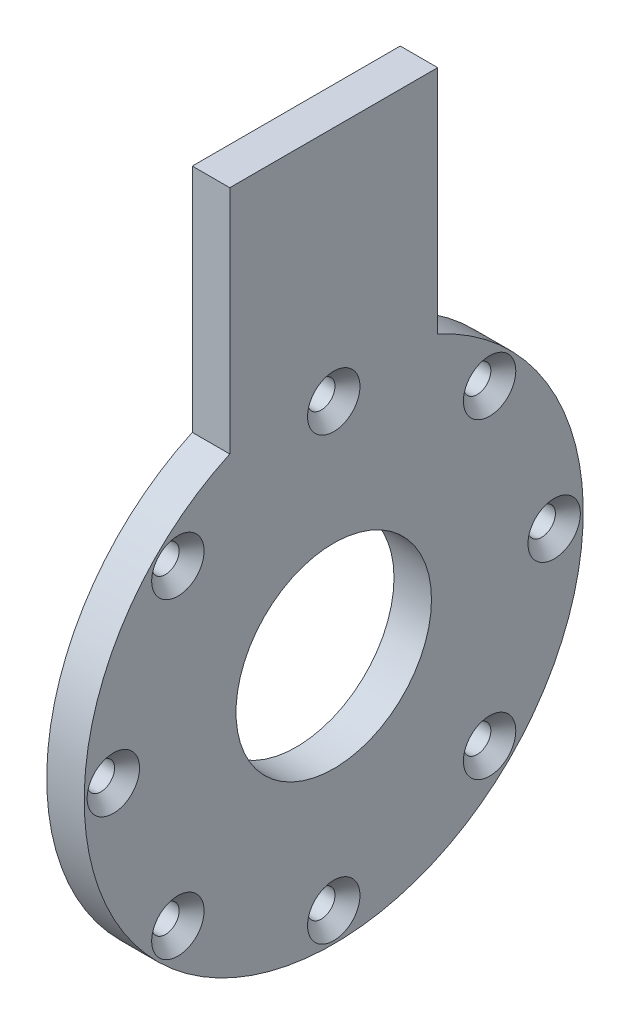
ISO-10303-21;
HEADER;
FILE_DESCRIPTION(('STEP AP214'),'2;1');
FILE_NAME('part.step','',(''),(''),'','','');
FILE_SCHEMA(('AUTOMOTIVE_DESIGN { 1 0 10303 214 1 1 1 1 }'));
ENDSEC;
DATA;
#1=APPLICATION_CONTEXT('core data for automotive mechanical design processes');
#2=APPLICATION_PROTOCOL_DEFINITION('international standard','automotive_design',2000,#1);
#3=PRODUCT_CONTEXT('',#1,'mechanical');
#4=PRODUCT('Part','Part','',(#3));
#5=PRODUCT_RELATED_PRODUCT_CATEGORY('part','',(#4));
#6=PRODUCT_DEFINITION_FORMATION('','',#4);
#7=PRODUCT_DEFINITION_CONTEXT('part definition',#1,'design');
#8=PRODUCT_DEFINITION('design','',#6,#7);
#9=PRODUCT_DEFINITION_SHAPE('','',#8);
#10=(LENGTH_UNIT() NAMED_UNIT(*) SI_UNIT(.MILLI.,.METRE.));
#11=(NAMED_UNIT(*) PLANE_ANGLE_UNIT() SI_UNIT($,.RADIAN.));
#12=(NAMED_UNIT(*) SI_UNIT($,.STERADIAN.) SOLID_ANGLE_UNIT());
#13=UNCERTAINTY_MEASURE_WITH_UNIT(LENGTH_MEASURE(1.E-05),#10,'distance_accuracy_value','');
#14=(GEOMETRIC_REPRESENTATION_CONTEXT(3) GLOBAL_UNCERTAINTY_ASSIGNED_CONTEXT((#13)) GLOBAL_UNIT_ASSIGNED_CONTEXT((#10,
#11,#12)) REPRESENTATION_CONTEXT('',''));
#15=CARTESIAN_POINT('',(0.,0.,0.));
#16=DIRECTION('',(0.,0.,1.));
#17=DIRECTION('',(1.,0.,0.));
#18=AXIS2_PLACEMENT_3D('',#15,#16,#17);
#19=CARTESIAN_POINT('',(-0.01,0.,0.));
#20=DIRECTION('',(1.,0.,0.));
#21=DIRECTION('',(0.,0.,-1.));
#22=AXIS2_PLACEMENT_3D('',#19,#20,#21);
#23=CYLINDRICAL_SURFACE('',#22,60.);
#24=DIRECTION('',(1.,0.,0.));
#25=VECTOR('',#24,1.);
#26=CARTESIAN_POINT('',(-0.01,54.5435605731786,-25.));
#27=LINE('',#26,#25);
#28=CARTESIAN_POINT('',(-0.01,54.5435605731786,-25.));
#29=VERTEX_POINT('',#28);
#30=CARTESIAN_POINT('',(9.,54.5435605731786,-25.));
#31=VERTEX_POINT('',#30);
#32=EDGE_CURVE('E55',#29,#31,#27,.T.);
#33=ORIENTED_EDGE('',*,*,#32,.T.);
#34=CARTESIAN_POINT('',(9.,0.,0.));
#35=DIRECTION('',(1.,0.,0.));
#36=DIRECTION('',(0.,0.,-1.));
#37=AXIS2_PLACEMENT_3D('',#34,#35,#36);
#38=CIRCLE('',#37,60.);
#39=CARTESIAN_POINT('',(9.,54.5435605731786,25.));
#40=VERTEX_POINT('',#39);
#41=EDGE_CURVE('E93',#40,#31,#38,.T.);
#42=ORIENTED_EDGE('',*,*,#41,.F.);
#43=DIRECTION('',(1.,0.,0.));
#44=VECTOR('',#43,1.);
#45=CARTESIAN_POINT('',(-0.01,54.5435605731786,25.));
#46=LINE('',#45,#44);
#47=CARTESIAN_POINT('',(-0.01,54.5435605731786,25.));
#48=VERTEX_POINT('',#47);
#49=EDGE_CURVE('E12',#48,#40,#46,.T.);
#50=ORIENTED_EDGE('',*,*,#49,.F.);
#51=CARTESIAN_POINT('',(-0.01,0.,0.));
#52=DIRECTION('',(1.,0.,0.));
#53=DIRECTION('',(0.,0.,-1.));
#54=AXIS2_PLACEMENT_3D('',#51,#52,#53);
#55=CIRCLE('',#54,60.);
#56=EDGE_CURVE('E94',#48,#29,#55,.T.);
#57=ORIENTED_EDGE('',*,*,#56,.T.);
#58=EDGE_LOOP('',(#33,#42,#50,#57));
#59=FACE_BOUND('',#58,.T.);
#60=ADVANCED_FACE('F52',(#59),#23,.T.);
#61=CARTESIAN_POINT('',(-0.01,110.,25.));
#62=DIRECTION('',(0.,0.,1.));
#63=DIRECTION('',(1.,0.,0.));
#64=AXIS2_PLACEMENT_3D('',#61,#62,#63);
#65=PLANE('',#64);
#66=ORIENTED_EDGE('',*,*,#49,.T.);
#67=DIRECTION('',(0.,-1.,0.));
#68=VECTOR('',#67,1.);
#69=CARTESIAN_POINT('',(9.,110.,25.));
#70=LINE('',#69,#68);
#71=CARTESIAN_POINT('',(9.,110.,25.));
#72=VERTEX_POINT('',#71);
#73=EDGE_CURVE('E113',#72,#40,#70,.T.);
#74=ORIENTED_EDGE('',*,*,#73,.F.);
#75=DIRECTION('',(1.,0.,0.));
#76=VECTOR('',#75,1.);
#77=CARTESIAN_POINT('',(-0.01,110.,25.));
#78=LINE('',#77,#76);
#79=CARTESIAN_POINT('',(-0.01,110.,25.));
#80=VERTEX_POINT('',#79);
#81=EDGE_CURVE('E61',#80,#72,#78,.T.);
#82=ORIENTED_EDGE('',*,*,#81,.F.);
#83=DIRECTION('',(0.,-1.,0.));
#84=VECTOR('',#83,1.);
#85=CARTESIAN_POINT('',(-0.01,110.,25.));
#86=LINE('',#85,#84);
#87=EDGE_CURVE('E100',#80,#48,#86,.T.);
#88=ORIENTED_EDGE('',*,*,#87,.T.);
#89=EDGE_LOOP('',(#66,#74,#82,#88));
#90=FACE_BOUND('',#89,.T.);
#91=ADVANCED_FACE('F387',(#90),#65,.T.);
#92=CARTESIAN_POINT('',(-0.01,110.,25.));
#93=DIRECTION('',(0.,1.,0.));
#94=DIRECTION('',(0.,0.,1.));
#95=AXIS2_PLACEMENT_3D('',#92,#93,#94);
#96=PLANE('',#95);
#97=ORIENTED_EDGE('',*,*,#81,.T.);
#98=DIRECTION('',(0.,0.,1.));
#99=VECTOR('',#98,1.);
#100=CARTESIAN_POINT('',(9.,110.,25.));
#101=LINE('',#100,#99);
#102=CARTESIAN_POINT('',(9.,110.,-25.));
#103=VERTEX_POINT('',#102);
#104=EDGE_CURVE('E108',#103,#72,#101,.T.);
#105=ORIENTED_EDGE('',*,*,#104,.F.);
#106=DIRECTION('',(1.,0.,0.));
#107=VECTOR('',#106,1.);
#108=CARTESIAN_POINT('',(-0.01,110.,-25.));
#109=LINE('',#108,#107);
#110=CARTESIAN_POINT('',(-0.01,110.,-25.));
#111=VERTEX_POINT('',#110);
#112=EDGE_CURVE('E99',#111,#103,#109,.T.);
#113=ORIENTED_EDGE('',*,*,#112,.F.);
#114=DIRECTION('',(0.,0.,1.));
#115=VECTOR('',#114,1.);
#116=CARTESIAN_POINT('',(-0.01,110.,25.));
#117=LINE('',#116,#115);
#118=EDGE_CURVE('E205',#111,#80,#117,.T.);
#119=ORIENTED_EDGE('',*,*,#118,.T.);
#120=EDGE_LOOP('',(#97,#105,#113,#119));
#121=FACE_BOUND('',#120,.T.);
#122=ADVANCED_FACE('F391',(#121),#96,.T.);
#123=CARTESIAN_POINT('',(-0.01,110.,-25.));
#124=DIRECTION('',(0.,0.,-1.));
#125=DIRECTION('',(-1.,0.,0.));
#126=AXIS2_PLACEMENT_3D('',#123,#124,#125);
#127=PLANE('',#126);
#128=ORIENTED_EDGE('',*,*,#112,.T.);
#129=DIRECTION('',(0.,1.,0.));
#130=VECTOR('',#129,1.);
#131=CARTESIAN_POINT('',(9.,110.,-25.));
#132=LINE('',#131,#130);
#133=EDGE_CURVE('E102',#31,#103,#132,.T.);
#134=ORIENTED_EDGE('',*,*,#133,.F.);
#135=ORIENTED_EDGE('',*,*,#32,.F.);
#136=DIRECTION('',(0.,1.,0.));
#137=VECTOR('',#136,1.);
#138=CARTESIAN_POINT('',(-0.01,110.,-25.));
#139=LINE('',#138,#137);
#140=EDGE_CURVE('E202',#29,#111,#139,.T.);
#141=ORIENTED_EDGE('',*,*,#140,.T.);
#142=EDGE_LOOP('',(#128,#134,#135,#141));
#143=FACE_BOUND('',#142,.T.);
#144=ADVANCED_FACE('F103',(#143),#127,.T.);
#145=CARTESIAN_POINT('',(-0.01,0.,0.));
#146=DIRECTION('',(1.,0.,0.));
#147=DIRECTION('',(0.,0.,-1.));
#148=AXIS2_PLACEMENT_3D('',#145,#146,#147);
#149=PLANE('',#148);
#150=CARTESIAN_POINT('',(-0.00999999999999959,53.,0.));
#151=DIRECTION('',(1.,0.,0.));
#152=DIRECTION('',(0.,0.,-1.));
#153=AXIS2_PLACEMENT_3D('',#150,#151,#152);
#154=CIRCLE('',#153,3.3);
#155=CARTESIAN_POINT('',(-0.00999999999999959,53.,-3.3));
#156=VERTEX_POINT('',#155);
#157=EDGE_CURVE('E321',#156,#156,#154,.T.);
#158=ORIENTED_EDGE('',*,*,#157,.T.);
#159=EDGE_LOOP('',(#158));
#160=FACE_BOUND('',#159,.T.);
#161=CARTESIAN_POINT('',(-0.00999999999999959,37.476659402887,-37.476659402887));
#162=DIRECTION('',(1.,0.,0.));
#163=DIRECTION('',(0.,0.,-1.));
#164=AXIS2_PLACEMENT_3D('',#161,#162,#163);
#165=CIRCLE('',#164,3.3);
#166=CARTESIAN_POINT('',(-0.00999999999999959,37.476659402887,-40.776659402887));
#167=VERTEX_POINT('',#166);
#168=EDGE_CURVE('E303',#167,#167,#165,.T.);
#169=ORIENTED_EDGE('',*,*,#168,.T.);
#170=EDGE_LOOP('',(#169));
#171=FACE_BOUND('',#170,.T.);
#172=CARTESIAN_POINT('',(-0.00999999999999959,-1.85048510958686E-13,-53.));
#173=DIRECTION('',(1.,0.,0.));
#174=DIRECTION('',(0.,0.,-1.));
#175=AXIS2_PLACEMENT_3D('',#172,#173,#174);
#176=CIRCLE('',#175,3.3);
#177=CARTESIAN_POINT('',(-0.00999999999999959,-1.85048510958686E-13,-56.3));
#178=VERTEX_POINT('',#177);
#179=EDGE_CURVE('E287',#178,#178,#176,.T.);
#180=ORIENTED_EDGE('',*,*,#179,.T.);
#181=EDGE_LOOP('',(#180));
#182=FACE_BOUND('',#181,.T.);
#183=CARTESIAN_POINT('',(-0.00999999999999959,-37.4766594028872,-37.4766594028868));
#184=DIRECTION('',(1.,0.,0.));
#185=DIRECTION('',(0.,0.,-1.));
#186=AXIS2_PLACEMENT_3D('',#183,#184,#185);
#187=CIRCLE('',#186,3.3);
#188=CARTESIAN_POINT('',(-0.00999999999999959,-37.4766594028872,-40.7766594028868));
#189=VERTEX_POINT('',#188);
#190=EDGE_CURVE('E271',#189,#189,#187,.T.);
#191=ORIENTED_EDGE('',*,*,#190,.T.);
#192=EDGE_LOOP('',(#191));
#193=FACE_BOUND('',#192,.T.);
#194=CARTESIAN_POINT('',(-0.00999999999999959,-53.,3.70097021917372E-13));
#195=DIRECTION('',(1.,0.,0.));
#196=DIRECTION('',(0.,0.,-1.));
#197=AXIS2_PLACEMENT_3D('',#194,#195,#196);
#198=CIRCLE('',#197,3.3);
#199=CARTESIAN_POINT('',(-0.00999999999999959,-53.,-3.29999999999963));
#200=VERTEX_POINT('',#199);
#201=EDGE_CURVE('E142',#200,#200,#198,.T.);
#202=ORIENTED_EDGE('',*,*,#201,.T.);
#203=EDGE_LOOP('',(#202));
#204=FACE_BOUND('',#203,.T.);
#205=CARTESIAN_POINT('',(-0.00999999999999959,-37.4766594028867,37.4766594028873));
#206=DIRECTION('',(1.,0.,0.));
#207=DIRECTION('',(0.,0.,-1.));
#208=AXIS2_PLACEMENT_3D('',#205,#206,#207);
#209=CIRCLE('',#208,3.3);
#210=CARTESIAN_POINT('',(-0.00999999999999959,-37.4766594028867,34.1766594028874));
#211=VERTEX_POINT('',#210);
#212=EDGE_CURVE('E157',#211,#211,#209,.T.);
#213=ORIENTED_EDGE('',*,*,#212,.T.);
#214=EDGE_LOOP('',(#213));
#215=FACE_BOUND('',#214,.T.);
#216=CARTESIAN_POINT('',(-0.00999999999999959,5.55145532876058E-13,53.));
#217=DIRECTION('',(1.,0.,0.));
#218=DIRECTION('',(0.,0.,-1.));
#219=AXIS2_PLACEMENT_3D('',#216,#217,#218);
#220=CIRCLE('',#219,3.3);
#221=CARTESIAN_POINT('',(-0.00999999999999959,5.55145532876058E-13,49.7));
#222=VERTEX_POINT('',#221);
#223=EDGE_CURVE('E174',#222,#222,#220,.T.);
#224=ORIENTED_EDGE('',*,*,#223,.T.);
#225=EDGE_LOOP('',(#224));
#226=FACE_BOUND('',#225,.T.);
#227=CARTESIAN_POINT('',(-0.00999999999999959,37.476659402887,37.476659402887));
#228=DIRECTION('',(1.,0.,0.));
#229=DIRECTION('',(0.,0.,-1.));
#230=AXIS2_PLACEMENT_3D('',#227,#228,#229);
#231=CIRCLE('',#230,3.3);
#232=CARTESIAN_POINT('',(-0.00999999999999959,37.476659402887,34.176659402887));
#233=VERTEX_POINT('',#232);
#234=EDGE_CURVE('E120',#233,#233,#231,.T.);
#235=ORIENTED_EDGE('',*,*,#234,.T.);
#236=EDGE_LOOP('',(#235));
#237=FACE_BOUND('',#236,.T.);
#238=CARTESIAN_POINT('',(-0.01,0.,0.));
#239=DIRECTION('',(1.,0.,0.));
#240=DIRECTION('',(0.,0.,-1.));
#241=AXIS2_PLACEMENT_3D('',#238,#239,#240);
#242=CIRCLE('',#241,23.5);
#243=CARTESIAN_POINT('',(-0.01,0.,-23.5));
#244=VERTEX_POINT('',#243);
#245=EDGE_CURVE('E193',#244,#244,#242,.T.);
#246=ORIENTED_EDGE('',*,*,#245,.T.);
#247=EDGE_LOOP('',(#246));
#248=FACE_BOUND('',#247,.T.);
#249=ORIENTED_EDGE('',*,*,#56,.F.);
#250=ORIENTED_EDGE('',*,*,#87,.F.);
#251=ORIENTED_EDGE('',*,*,#118,.F.);
#252=ORIENTED_EDGE('',*,*,#140,.F.);
#253=EDGE_LOOP('',(#249,#250,#251,#252));
#254=FACE_BOUND('',#253,.T.);
#255=ADVANCED_FACE('F399',(#160,#171,#182,#193,#204,#215,#226,#237,#248,#254),#149,.F.);
#256=CARTESIAN_POINT('',(-0.01,0.,0.));
#257=DIRECTION('',(1.,0.,0.));
#258=DIRECTION('',(0.,0.,-1.));
#259=AXIS2_PLACEMENT_3D('',#256,#257,#258);
#260=CYLINDRICAL_SURFACE('',#259,23.5);
#261=ORIENTED_EDGE('',*,*,#245,.F.);
#262=EDGE_LOOP('',(#261));
#263=FACE_BOUND('',#262,.T.);
#264=CARTESIAN_POINT('',(9.,0.,0.));
#265=DIRECTION('',(1.,0.,0.));
#266=DIRECTION('',(0.,0.,-1.));
#267=AXIS2_PLACEMENT_3D('',#264,#265,#266);
#268=CIRCLE('',#267,23.5);
#269=CARTESIAN_POINT('',(9.,0.,-23.5));
#270=VERTEX_POINT('',#269);
#271=EDGE_CURVE('E115',#270,#270,#268,.T.);
#272=ORIENTED_EDGE('',*,*,#271,.T.);
#273=EDGE_LOOP('',(#272));
#274=FACE_BOUND('',#273,.T.);
#275=ADVANCED_FACE('F355',(#263,#274),#260,.F.);
#276=CARTESIAN_POINT('',(9.,0.,0.));
#277=DIRECTION('',(1.,0.,0.));
#278=DIRECTION('',(0.,0.,-1.));
#279=AXIS2_PLACEMENT_3D('',#276,#277,#278);
#280=PLANE('',#279);
#281=CARTESIAN_POINT('',(9.,53.,0.));
#282=DIRECTION('',(1.,0.,0.));
#283=DIRECTION('',(0.,0.,-1.));
#284=AXIS2_PLACEMENT_3D('',#281,#282,#283);
#285=CIRCLE('',#284,6.3);
#286=CARTESIAN_POINT('',(9.,53.,-6.3));
#287=VERTEX_POINT('',#286);
#288=EDGE_CURVE('E332',#287,#287,#285,.T.);
#289=ORIENTED_EDGE('',*,*,#288,.F.);
#290=EDGE_LOOP('',(#289));
#291=FACE_BOUND('',#290,.T.);
#292=CARTESIAN_POINT('',(9.,37.476659402887,-37.476659402887));
#293=DIRECTION('',(1.,0.,0.));
#294=DIRECTION('',(0.,0.,-1.));
#295=AXIS2_PLACEMENT_3D('',#292,#293,#294);
#296=CIRCLE('',#295,6.3);
#297=CARTESIAN_POINT('',(9.,37.476659402887,-43.776659402887));
#298=VERTEX_POINT('',#297);
#299=EDGE_CURVE('E315',#298,#298,#296,.T.);
#300=ORIENTED_EDGE('',*,*,#299,.F.);
#301=EDGE_LOOP('',(#300));
#302=FACE_BOUND('',#301,.T.);
#303=CARTESIAN_POINT('',(9.,-1.85048510958686E-13,-53.));
#304=DIRECTION('',(1.,0.,0.));
#305=DIRECTION('',(0.,0.,-1.));
#306=AXIS2_PLACEMENT_3D('',#303,#304,#305);
#307=CIRCLE('',#306,6.3);
#308=CARTESIAN_POINT('',(9.,-1.85048510958686E-13,-59.3));
#309=VERTEX_POINT('',#308);
#310=EDGE_CURVE('E297',#309,#309,#307,.T.);
#311=ORIENTED_EDGE('',*,*,#310,.F.);
#312=EDGE_LOOP('',(#311));
#313=FACE_BOUND('',#312,.T.);
#314=CARTESIAN_POINT('',(9.,-37.4766594028872,-37.4766594028868));
#315=DIRECTION('',(1.,0.,0.));
#316=DIRECTION('',(0.,0.,-1.));
#317=AXIS2_PLACEMENT_3D('',#314,#315,#316);
#318=CIRCLE('',#317,6.3);
#319=CARTESIAN_POINT('',(9.,-37.4766594028872,-43.7766594028868));
#320=VERTEX_POINT('',#319);
#321=EDGE_CURVE('E281',#320,#320,#318,.T.);
#322=ORIENTED_EDGE('',*,*,#321,.F.);
#323=EDGE_LOOP('',(#322));
#324=FACE_BOUND('',#323,.T.);
#325=CARTESIAN_POINT('',(9.,-53.,3.70097021917372E-13));
#326=DIRECTION('',(1.,0.,0.));
#327=DIRECTION('',(0.,0.,-1.));
#328=AXIS2_PLACEMENT_3D('',#325,#326,#327);
#329=CIRCLE('',#328,6.3);
#330=CARTESIAN_POINT('',(9.,-53.,-6.29999999999963));
#331=VERTEX_POINT('',#330);
#332=EDGE_CURVE('E143',#331,#331,#329,.T.);
#333=ORIENTED_EDGE('',*,*,#332,.F.);
#334=EDGE_LOOP('',(#333));
#335=FACE_BOUND('',#334,.T.);
#336=CARTESIAN_POINT('',(9.,-37.4766594028867,37.4766594028873));
#337=DIRECTION('',(1.,0.,0.));
#338=DIRECTION('',(0.,0.,-1.));
#339=AXIS2_PLACEMENT_3D('',#336,#337,#338);
#340=CIRCLE('',#339,6.3);
#341=CARTESIAN_POINT('',(9.,-37.4766594028867,31.1766594028873));
#342=VERTEX_POINT('',#341);
#343=EDGE_CURVE('E149',#342,#342,#340,.T.);
#344=ORIENTED_EDGE('',*,*,#343,.F.);
#345=EDGE_LOOP('',(#344));
#346=FACE_BOUND('',#345,.T.);
#347=CARTESIAN_POINT('',(9.,5.55145532876058E-13,53.));
#348=DIRECTION('',(1.,0.,0.));
#349=DIRECTION('',(0.,0.,-1.));
#350=AXIS2_PLACEMENT_3D('',#347,#348,#349);
#351=CIRCLE('',#350,6.3);
#352=CARTESIAN_POINT('',(9.,5.55145532876058E-13,46.7));
#353=VERTEX_POINT('',#352);
#354=EDGE_CURVE('E162',#353,#353,#351,.T.);
#355=ORIENTED_EDGE('',*,*,#354,.F.);
#356=EDGE_LOOP('',(#355));
#357=FACE_BOUND('',#356,.T.);
#358=CARTESIAN_POINT('',(9.,37.476659402887,37.476659402887));
#359=DIRECTION('',(1.,0.,0.));
#360=DIRECTION('',(0.,0.,-1.));
#361=AXIS2_PLACEMENT_3D('',#358,#359,#360);
#362=CIRCLE('',#361,6.3);
#363=CARTESIAN_POINT('',(9.,37.476659402887,31.176659402887));
#364=VERTEX_POINT('',#363);
#365=EDGE_CURVE('E178',#364,#364,#362,.T.);
#366=ORIENTED_EDGE('',*,*,#365,.F.);
#367=EDGE_LOOP('',(#366));
#368=FACE_BOUND('',#367,.T.);
#369=ORIENTED_EDGE('',*,*,#41,.T.);
#370=ORIENTED_EDGE('',*,*,#133,.T.);
#371=ORIENTED_EDGE('',*,*,#104,.T.);
#372=ORIENTED_EDGE('',*,*,#73,.T.);
#373=EDGE_LOOP('',(#369,#370,#371,#372));
#374=FACE_BOUND('',#373,.T.);
#375=ORIENTED_EDGE('',*,*,#271,.F.);
#376=EDGE_LOOP('',(#375));
#377=FACE_BOUND('',#376,.T.);
#378=ADVANCED_FACE('F111',(#291,#302,#313,#324,#335,#346,#357,#368,#374,#377),#280,.T.);
#379=CARTESIAN_POINT('',(9.,37.476659402887,37.476659402887));
#380=DIRECTION('',(1.,0.,0.));
#381=DIRECTION('',(0.,0.,-1.));
#382=AXIS2_PLACEMENT_3D('',#379,#380,#381);
#383=CYLINDRICAL_SURFACE('',#382,3.3);
#384=ORIENTED_EDGE('',*,*,#234,.F.);
#385=EDGE_LOOP('',(#384));
#386=FACE_BOUND('',#385,.T.);
#387=CARTESIAN_POINT('',(6.,37.476659402887,37.476659402887));
#388=DIRECTION('',(1.,0.,0.));
#389=DIRECTION('',(0.,0.,-1.));
#390=AXIS2_PLACEMENT_3D('',#387,#388,#389);
#391=CIRCLE('',#390,3.3);
#392=CARTESIAN_POINT('',(6.,37.476659402887,34.176659402887));
#393=VERTEX_POINT('',#392);
#394=EDGE_CURVE('E182',#393,#393,#391,.T.);
#395=ORIENTED_EDGE('',*,*,#394,.T.);
#396=EDGE_LOOP('',(#395));
#397=FACE_BOUND('',#396,.T.);
#398=ADVANCED_FACE('F354',(#386,#397),#383,.F.);
#399=CARTESIAN_POINT('',(9.,37.476659402887,37.476659402887));
#400=DIRECTION('',(1.,0.,0.));
#401=DIRECTION('',(0.,0.,-1.));
#402=AXIS2_PLACEMENT_3D('',#399,#400,#401);
#403=CONICAL_SURFACE('',#402,6.3,0.785398163397449);
#404=ORIENTED_EDGE('',*,*,#394,.F.);
#405=EDGE_LOOP('',(#404));
#406=FACE_BOUND('',#405,.T.);
#407=ORIENTED_EDGE('',*,*,#365,.T.);
#408=EDGE_LOOP('',(#407));
#409=FACE_BOUND('',#408,.T.);
#410=ADVANCED_FACE('F371',(#406,#409),#403,.F.);
#411=CARTESIAN_POINT('',(9.,5.55145532876058E-13,53.));
#412=DIRECTION('',(1.,0.,0.));
#413=DIRECTION('',(0.,0.,-1.));
#414=AXIS2_PLACEMENT_3D('',#411,#412,#413);
#415=CYLINDRICAL_SURFACE('',#414,3.3);
#416=ORIENTED_EDGE('',*,*,#223,.F.);
#417=EDGE_LOOP('',(#416));
#418=FACE_BOUND('',#417,.T.);
#419=CARTESIAN_POINT('',(6.,5.55145532876058E-13,53.));
#420=DIRECTION('',(1.,0.,0.));
#421=DIRECTION('',(0.,0.,-1.));
#422=AXIS2_PLACEMENT_3D('',#419,#420,#421);
#423=CIRCLE('',#422,3.3);
#424=CARTESIAN_POINT('',(6.,5.55145532876058E-13,49.7));
#425=VERTEX_POINT('',#424);
#426=EDGE_CURVE('E169',#425,#425,#423,.T.);
#427=ORIENTED_EDGE('',*,*,#426,.T.);
#428=EDGE_LOOP('',(#427));
#429=FACE_BOUND('',#428,.T.);
#430=ADVANCED_FACE('F373',(#418,#429),#415,.F.);
#431=CARTESIAN_POINT('',(9.,5.55145532876058E-13,53.));
#432=DIRECTION('',(1.,0.,0.));
#433=DIRECTION('',(0.,0.,-1.));
#434=AXIS2_PLACEMENT_3D('',#431,#432,#433);
#435=CONICAL_SURFACE('',#434,6.3,0.785398163397448);
#436=ORIENTED_EDGE('',*,*,#426,.F.);
#437=EDGE_LOOP('',(#436));
#438=FACE_BOUND('',#437,.T.);
#439=ORIENTED_EDGE('',*,*,#354,.T.);
#440=EDGE_LOOP('',(#439));
#441=FACE_BOUND('',#440,.T.);
#442=ADVANCED_FACE('F380',(#438,#441),#435,.F.);
#443=CARTESIAN_POINT('',(9.,-37.4766594028867,37.4766594028873));
#444=DIRECTION('',(1.,0.,0.));
#445=DIRECTION('',(0.,0.,-1.));
#446=AXIS2_PLACEMENT_3D('',#443,#444,#445);
#447=CYLINDRICAL_SURFACE('',#446,3.3);
#448=ORIENTED_EDGE('',*,*,#212,.F.);
#449=EDGE_LOOP('',(#448));
#450=FACE_BOUND('',#449,.T.);
#451=CARTESIAN_POINT('',(6.,-37.4766594028867,37.4766594028873));
#452=DIRECTION('',(1.,0.,0.));
#453=DIRECTION('',(0.,0.,-1.));
#454=AXIS2_PLACEMENT_3D('',#451,#452,#453);
#455=CIRCLE('',#454,3.3);
#456=CARTESIAN_POINT('',(6.,-37.4766594028867,34.1766594028874));
#457=VERTEX_POINT('',#456);
#458=EDGE_CURVE('E153',#457,#457,#455,.T.);
#459=ORIENTED_EDGE('',*,*,#458,.T.);
#460=EDGE_LOOP('',(#459));
#461=FACE_BOUND('',#460,.T.);
#462=ADVANCED_FACE('F438',(#450,#461),#447,.F.);
#463=CARTESIAN_POINT('',(9.,-37.4766594028867,37.4766594028873));
#464=DIRECTION('',(1.,0.,0.));
#465=DIRECTION('',(0.,0.,-1.));
#466=AXIS2_PLACEMENT_3D('',#463,#464,#465);
#467=CONICAL_SURFACE('',#466,6.3,0.785398163397449);
#468=ORIENTED_EDGE('',*,*,#458,.F.);
#469=EDGE_LOOP('',(#468));
#470=FACE_BOUND('',#469,.T.);
#471=ORIENTED_EDGE('',*,*,#343,.T.);
#472=EDGE_LOOP('',(#471));
#473=FACE_BOUND('',#472,.T.);
#474=ADVANCED_FACE('F443',(#470,#473),#467,.F.);
#475=CARTESIAN_POINT('',(9.,-53.,3.70097021917372E-13));
#476=DIRECTION('',(1.,0.,0.));
#477=DIRECTION('',(0.,0.,-1.));
#478=AXIS2_PLACEMENT_3D('',#475,#476,#477);
#479=CYLINDRICAL_SURFACE('',#478,3.3);
#480=ORIENTED_EDGE('',*,*,#201,.F.);
#481=EDGE_LOOP('',(#480));
#482=FACE_BOUND('',#481,.T.);
#483=CARTESIAN_POINT('',(6.,-53.,3.70097021917372E-13));
#484=DIRECTION('',(1.,0.,0.));
#485=DIRECTION('',(0.,0.,-1.));
#486=AXIS2_PLACEMENT_3D('',#483,#484,#485);
#487=CIRCLE('',#486,3.3);
#488=CARTESIAN_POINT('',(6.,-53.,-3.29999999999963));
#489=VERTEX_POINT('',#488);
#490=EDGE_CURVE('E136',#489,#489,#487,.T.);
#491=ORIENTED_EDGE('',*,*,#490,.T.);
#492=EDGE_LOOP('',(#491));
#493=FACE_BOUND('',#492,.T.);
#494=ADVANCED_FACE('F449',(#482,#493),#479,.F.);
#495=CARTESIAN_POINT('',(9.,-53.,3.70097021917372E-13));
#496=DIRECTION('',(1.,0.,0.));
#497=DIRECTION('',(0.,0.,-1.));
#498=AXIS2_PLACEMENT_3D('',#495,#496,#497);
#499=CONICAL_SURFACE('',#498,6.3,0.785398163397449);
#500=ORIENTED_EDGE('',*,*,#490,.F.);
#501=EDGE_LOOP('',(#500));
#502=FACE_BOUND('',#501,.T.);
#503=ORIENTED_EDGE('',*,*,#332,.T.);
#504=EDGE_LOOP('',(#503));
#505=FACE_BOUND('',#504,.T.);
#506=ADVANCED_FACE('F453',(#502,#505),#499,.F.);
#507=CARTESIAN_POINT('',(9.,-37.4766594028872,-37.4766594028868));
#508=DIRECTION('',(1.,0.,0.));
#509=DIRECTION('',(0.,0.,-1.));
#510=AXIS2_PLACEMENT_3D('',#507,#508,#509);
#511=CYLINDRICAL_SURFACE('',#510,3.3);
#512=ORIENTED_EDGE('',*,*,#190,.F.);
#513=EDGE_LOOP('',(#512));
#514=FACE_BOUND('',#513,.T.);
#515=CARTESIAN_POINT('',(6.,-37.4766594028872,-37.4766594028868));
#516=DIRECTION('',(1.,0.,0.));
#517=DIRECTION('',(0.,0.,-1.));
#518=AXIS2_PLACEMENT_3D('',#515,#516,#517);
#519=CIRCLE('',#518,3.3);
#520=CARTESIAN_POINT('',(6.,-37.4766594028872,-40.7766594028868));
#521=VERTEX_POINT('',#520);
#522=EDGE_CURVE('E276',#521,#521,#519,.T.);
#523=ORIENTED_EDGE('',*,*,#522,.T.);
#524=EDGE_LOOP('',(#523));
#525=FACE_BOUND('',#524,.T.);
#526=ADVANCED_FACE('F457',(#514,#525),#511,.F.);
#527=CARTESIAN_POINT('',(9.,-37.4766594028872,-37.4766594028868));
#528=DIRECTION('',(1.,0.,0.));
#529=DIRECTION('',(0.,0.,-1.));
#530=AXIS2_PLACEMENT_3D('',#527,#528,#529);
#531=CONICAL_SURFACE('',#530,6.3,0.785398163397449);
#532=ORIENTED_EDGE('',*,*,#522,.F.);
#533=EDGE_LOOP('',(#532));
#534=FACE_BOUND('',#533,.T.);
#535=ORIENTED_EDGE('',*,*,#321,.T.);
#536=EDGE_LOOP('',(#535));
#537=FACE_BOUND('',#536,.T.);
#538=ADVANCED_FACE('F461',(#534,#537),#531,.F.);
#539=CARTESIAN_POINT('',(9.,-1.85048510958686E-13,-53.));
#540=DIRECTION('',(1.,0.,0.));
#541=DIRECTION('',(0.,0.,-1.));
#542=AXIS2_PLACEMENT_3D('',#539,#540,#541);
#543=CYLINDRICAL_SURFACE('',#542,3.3);
#544=ORIENTED_EDGE('',*,*,#179,.F.);
#545=EDGE_LOOP('',(#544));
#546=FACE_BOUND('',#545,.T.);
#547=CARTESIAN_POINT('',(6.,-1.85048510958686E-13,-53.));
#548=DIRECTION('',(1.,0.,0.));
#549=DIRECTION('',(0.,0.,-1.));
#550=AXIS2_PLACEMENT_3D('',#547,#548,#549);
#551=CIRCLE('',#550,3.3);
#552=CARTESIAN_POINT('',(6.,-1.85048510958686E-13,-56.3));
#553=VERTEX_POINT('',#552);
#554=EDGE_CURVE('E292',#553,#553,#551,.T.);
#555=ORIENTED_EDGE('',*,*,#554,.T.);
#556=EDGE_LOOP('',(#555));
#557=FACE_BOUND('',#556,.T.);
#558=ADVANCED_FACE('F465',(#546,#557),#543,.F.);
#559=CARTESIAN_POINT('',(9.,-1.85048510958686E-13,-53.));
#560=DIRECTION('',(1.,0.,0.));
#561=DIRECTION('',(0.,0.,-1.));
#562=AXIS2_PLACEMENT_3D('',#559,#560,#561);
#563=CONICAL_SURFACE('',#562,6.3,0.785398163397448);
#564=ORIENTED_EDGE('',*,*,#554,.F.);
#565=EDGE_LOOP('',(#564));
#566=FACE_BOUND('',#565,.T.);
#567=ORIENTED_EDGE('',*,*,#310,.T.);
#568=EDGE_LOOP('',(#567));
#569=FACE_BOUND('',#568,.T.);
#570=ADVANCED_FACE('F469',(#566,#569),#563,.F.);
#571=CARTESIAN_POINT('',(9.,37.476659402887,-37.476659402887));
#572=DIRECTION('',(1.,0.,0.));
#573=DIRECTION('',(0.,0.,-1.));
#574=AXIS2_PLACEMENT_3D('',#571,#572,#573);
#575=CYLINDRICAL_SURFACE('',#574,3.3);
#576=ORIENTED_EDGE('',*,*,#168,.F.);
#577=EDGE_LOOP('',(#576));
#578=FACE_BOUND('',#577,.T.);
#579=CARTESIAN_POINT('',(6.,37.476659402887,-37.476659402887));
#580=DIRECTION('',(1.,0.,0.));
#581=DIRECTION('',(0.,0.,-1.));
#582=AXIS2_PLACEMENT_3D('',#579,#580,#581);
#583=CIRCLE('',#582,3.3);
#584=CARTESIAN_POINT('',(6.,37.476659402887,-40.776659402887));
#585=VERTEX_POINT('',#584);
#586=EDGE_CURVE('E309',#585,#585,#583,.T.);
#587=ORIENTED_EDGE('',*,*,#586,.T.);
#588=EDGE_LOOP('',(#587));
#589=FACE_BOUND('',#588,.T.);
#590=ADVANCED_FACE('F473',(#578,#589),#575,.F.);
#591=CARTESIAN_POINT('',(9.,37.476659402887,-37.476659402887));
#592=DIRECTION('',(1.,0.,0.));
#593=DIRECTION('',(0.,0.,-1.));
#594=AXIS2_PLACEMENT_3D('',#591,#592,#593);
#595=CONICAL_SURFACE('',#594,6.3,0.785398163397449);
#596=ORIENTED_EDGE('',*,*,#586,.F.);
#597=EDGE_LOOP('',(#596));
#598=FACE_BOUND('',#597,.T.);
#599=ORIENTED_EDGE('',*,*,#299,.T.);
#600=EDGE_LOOP('',(#599));
#601=FACE_BOUND('',#600,.T.);
#602=ADVANCED_FACE('F477',(#598,#601),#595,.F.);
#603=CARTESIAN_POINT('',(9.,53.,0.));
#604=DIRECTION('',(1.,0.,0.));
#605=DIRECTION('',(0.,0.,-1.));
#606=AXIS2_PLACEMENT_3D('',#603,#604,#605);
#607=CYLINDRICAL_SURFACE('',#606,3.3);
#608=ORIENTED_EDGE('',*,*,#157,.F.);
#609=EDGE_LOOP('',(#608));
#610=FACE_BOUND('',#609,.T.);
#611=CARTESIAN_POINT('',(6.,53.,0.));
#612=DIRECTION('',(1.,0.,0.));
#613=DIRECTION('',(0.,0.,-1.));
#614=AXIS2_PLACEMENT_3D('',#611,#612,#613);
#615=CIRCLE('',#614,3.3);
#616=CARTESIAN_POINT('',(6.,53.,-3.3));
#617=VERTEX_POINT('',#616);
#618=EDGE_CURVE('E326',#617,#617,#615,.T.);
#619=ORIENTED_EDGE('',*,*,#618,.T.);
#620=EDGE_LOOP('',(#619));
#621=FACE_BOUND('',#620,.T.);
#622=ADVANCED_FACE('F481',(#610,#621),#607,.F.);
#623=CARTESIAN_POINT('',(9.,53.,0.));
#624=DIRECTION('',(1.,0.,0.));
#625=DIRECTION('',(0.,0.,-1.));
#626=AXIS2_PLACEMENT_3D('',#623,#624,#625);
#627=CONICAL_SURFACE('',#626,6.3,0.785398163397449);
#628=ORIENTED_EDGE('',*,*,#618,.F.);
#629=EDGE_LOOP('',(#628));
#630=FACE_BOUND('',#629,.T.);
#631=ORIENTED_EDGE('',*,*,#288,.T.);
#632=EDGE_LOOP('',(#631));
#633=FACE_BOUND('',#632,.T.);
#634=ADVANCED_FACE('F350',(#630,#633),#627,.F.);
#635=CLOSED_SHELL('',(#60,#91,#122,#144,#255,#275,#378,#398,#410,#430,#442,#462,#474,#494,#506,
#526,#538,#558,#570,#590,#602,#622,#634));
#636=MANIFOLD_SOLID_BREP('B2',#635);
#637=ADVANCED_BREP_SHAPE_REPRESENTATION('',(#18,#636),#14);
#638=SHAPE_DEFINITION_REPRESENTATION(#9,#637);
ENDSEC;
END-ISO-10303-21;
